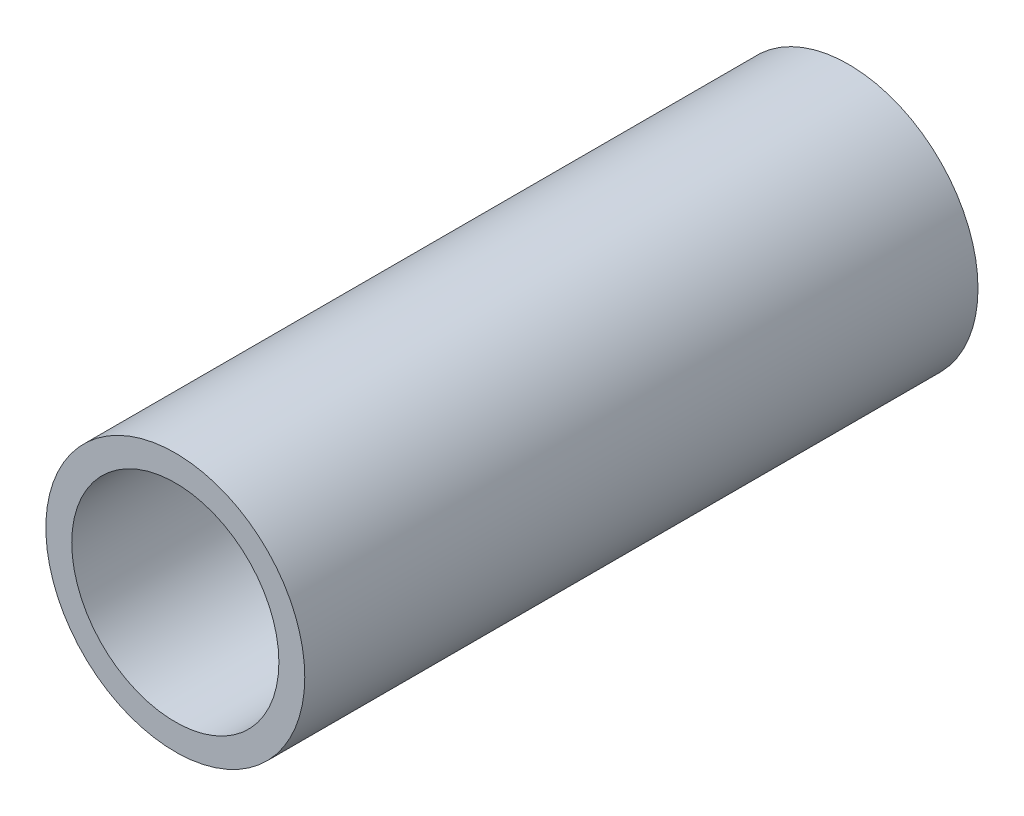
ISO-10303-21;
HEADER;
FILE_DESCRIPTION(('STEP AP214'),'2;1');
FILE_NAME('part.step','',(''),(''),'','','');
FILE_SCHEMA(('AUTOMOTIVE_DESIGN { 1 0 10303 214 1 1 1 1 }'));
ENDSEC;
DATA;
#1=APPLICATION_CONTEXT('core data for automotive mechanical design processes');
#2=APPLICATION_PROTOCOL_DEFINITION('international standard','automotive_design',2000,#1);
#3=PRODUCT_CONTEXT('',#1,'mechanical');
#4=PRODUCT('Part','Part','',(#3));
#5=PRODUCT_RELATED_PRODUCT_CATEGORY('part','',(#4));
#6=PRODUCT_DEFINITION_FORMATION('','',#4);
#7=PRODUCT_DEFINITION_CONTEXT('part definition',#1,'design');
#8=PRODUCT_DEFINITION('design','',#6,#7);
#9=PRODUCT_DEFINITION_SHAPE('','',#8);
#10=(LENGTH_UNIT() NAMED_UNIT(*) SI_UNIT(.MILLI.,.METRE.));
#11=(NAMED_UNIT(*) PLANE_ANGLE_UNIT() SI_UNIT($,.RADIAN.));
#12=(NAMED_UNIT(*) SI_UNIT($,.STERADIAN.) SOLID_ANGLE_UNIT());
#13=UNCERTAINTY_MEASURE_WITH_UNIT(LENGTH_MEASURE(1.E-05),#10,'distance_accuracy_value','');
#14=(GEOMETRIC_REPRESENTATION_CONTEXT(3) GLOBAL_UNCERTAINTY_ASSIGNED_CONTEXT((#13)) GLOBAL_UNIT_ASSIGNED_CONTEXT((#10,
#11,#12)) REPRESENTATION_CONTEXT('',''));
#15=CARTESIAN_POINT('',(0.,0.,0.));
#16=DIRECTION('',(0.,0.,1.));
#17=DIRECTION('',(1.,0.,0.));
#18=AXIS2_PLACEMENT_3D('',#15,#16,#17);
#19=CARTESIAN_POINT('',(0.,0.,6.5));
#20=DIRECTION('',(0.,0.,1.));
#21=DIRECTION('',(1.,0.,0.));
#22=AXIS2_PLACEMENT_3D('',#19,#20,#21);
#23=PLANE('',#22);
#24=CARTESIAN_POINT('',(0.,0.,6.5));
#25=DIRECTION('',(0.,0.,1.));
#26=DIRECTION('',(1.,0.,0.));
#27=AXIS2_PLACEMENT_3D('',#24,#25,#26);
#28=CIRCLE('',#27,1.25);
#29=CARTESIAN_POINT('',(1.25,0.,6.5));
#30=VERTEX_POINT('',#29);
#31=EDGE_CURVE('E10',#30,#30,#28,.T.);
#32=ORIENTED_EDGE('',*,*,#31,.T.);
#33=EDGE_LOOP('',(#32));
#34=FACE_BOUND('',#33,.T.);
#35=CARTESIAN_POINT('',(0.,0.,6.5));
#36=DIRECTION('',(0.,0.,1.));
#37=DIRECTION('',(1.,0.,0.));
#38=AXIS2_PLACEMENT_3D('',#35,#36,#37);
#39=CIRCLE('',#38,1.);
#40=CARTESIAN_POINT('',(1.,0.,6.5));
#41=VERTEX_POINT('',#40);
#42=EDGE_CURVE('E41',#41,#41,#39,.T.);
#43=ORIENTED_EDGE('',*,*,#42,.F.);
#44=EDGE_LOOP('',(#43));
#45=FACE_BOUND('',#44,.T.);
#46=ADVANCED_FACE('F30',(#34,#45),#23,.T.);
#47=CARTESIAN_POINT('',(0.,0.,0.));
#48=DIRECTION('',(0.,0.,1.));
#49=DIRECTION('',(1.,0.,0.));
#50=AXIS2_PLACEMENT_3D('',#47,#48,#49);
#51=PLANE('',#50);
#52=CARTESIAN_POINT('',(0.,0.,0.));
#53=DIRECTION('',(0.,0.,1.));
#54=DIRECTION('',(1.,0.,0.));
#55=AXIS2_PLACEMENT_3D('',#52,#53,#54);
#56=CIRCLE('',#55,1.25);
#57=CARTESIAN_POINT('',(1.25,0.,0.));
#58=VERTEX_POINT('',#57);
#59=EDGE_CURVE('E34',#58,#58,#56,.T.);
#60=ORIENTED_EDGE('',*,*,#59,.F.);
#61=EDGE_LOOP('',(#60));
#62=FACE_BOUND('',#61,.T.);
#63=CARTESIAN_POINT('',(0.,0.,0.));
#64=DIRECTION('',(0.,0.,1.));
#65=DIRECTION('',(1.,0.,0.));
#66=AXIS2_PLACEMENT_3D('',#63,#64,#65);
#67=CIRCLE('',#66,1.);
#68=CARTESIAN_POINT('',(1.,0.,0.));
#69=VERTEX_POINT('',#68);
#70=EDGE_CURVE('E43',#69,#69,#67,.T.);
#71=ORIENTED_EDGE('',*,*,#70,.T.);
#72=EDGE_LOOP('',(#71));
#73=FACE_BOUND('',#72,.T.);
#74=ADVANCED_FACE('F53',(#62,#73),#51,.F.);
#75=CARTESIAN_POINT('',(0.,0.,6.5));
#76=DIRECTION('',(0.,0.,-1.));
#77=DIRECTION('',(-1.,0.,0.));
#78=AXIS2_PLACEMENT_3D('',#75,#76,#77);
#79=CYLINDRICAL_SURFACE('',#78,1.25);
#80=ORIENTED_EDGE('',*,*,#31,.F.);
#81=EDGE_LOOP('',(#80));
#82=FACE_BOUND('',#81,.T.);
#83=ORIENTED_EDGE('',*,*,#59,.T.);
#84=EDGE_LOOP('',(#83));
#85=FACE_BOUND('',#84,.T.);
#86=ADVANCED_FACE('F32',(#82,#85),#79,.T.);
#87=CARTESIAN_POINT('',(0.,0.,6.5));
#88=DIRECTION('',(0.,0.,-1.));
#89=DIRECTION('',(-1.,0.,0.));
#90=AXIS2_PLACEMENT_3D('',#87,#88,#89);
#91=CYLINDRICAL_SURFACE('',#90,1.);
#92=ORIENTED_EDGE('',*,*,#42,.T.);
#93=EDGE_LOOP('',(#92));
#94=FACE_BOUND('',#93,.T.);
#95=ORIENTED_EDGE('',*,*,#70,.F.);
#96=EDGE_LOOP('',(#95));
#97=FACE_BOUND('',#96,.T.);
#98=ADVANCED_FACE('F49',(#94,#97),#91,.F.);
#99=CLOSED_SHELL('',(#46,#74,#86,#98));
#100=MANIFOLD_SOLID_BREP('B2',#99);
#101=ADVANCED_BREP_SHAPE_REPRESENTATION('',(#18,#100),#14);
#102=SHAPE_DEFINITION_REPRESENTATION(#9,#101);
ENDSEC;
END-ISO-10303-21;
